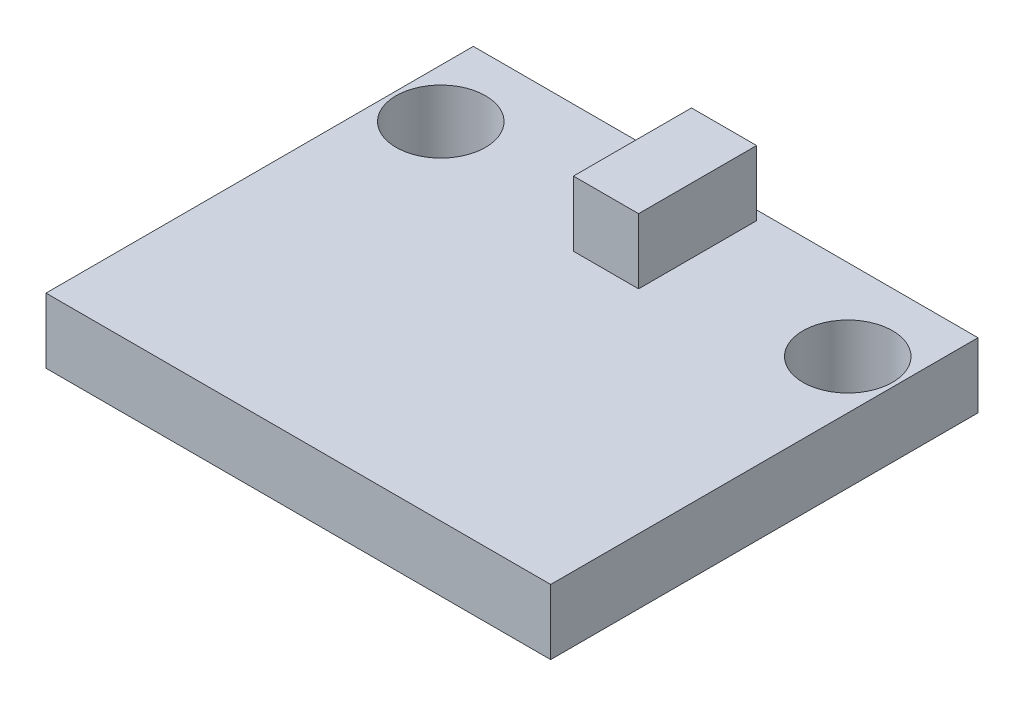
ISO-10303-21;
HEADER;
FILE_DESCRIPTION(('STEP AP214'),'2;1');
FILE_NAME('part.step','',(''),(''),'','','');
FILE_SCHEMA(('AUTOMOTIVE_DESIGN { 1 0 10303 214 1 1 1 1 }'));
ENDSEC;
DATA;
#1=APPLICATION_CONTEXT('core data for automotive mechanical design processes');
#2=APPLICATION_PROTOCOL_DEFINITION('international standard','automotive_design',2000,#1);
#3=PRODUCT_CONTEXT('',#1,'mechanical');
#4=PRODUCT('Part','Part','',(#3));
#5=PRODUCT_RELATED_PRODUCT_CATEGORY('part','',(#4));
#6=PRODUCT_DEFINITION_FORMATION('','',#4);
#7=PRODUCT_DEFINITION_CONTEXT('part definition',#1,'design');
#8=PRODUCT_DEFINITION('design','',#6,#7);
#9=PRODUCT_DEFINITION_SHAPE('','',#8);
#10=(LENGTH_UNIT() NAMED_UNIT(*) SI_UNIT(.MILLI.,.METRE.));
#11=(NAMED_UNIT(*) PLANE_ANGLE_UNIT() SI_UNIT($,.RADIAN.));
#12=(NAMED_UNIT(*) SI_UNIT($,.STERADIAN.) SOLID_ANGLE_UNIT());
#13=UNCERTAINTY_MEASURE_WITH_UNIT(LENGTH_MEASURE(1.E-05),#10,'distance_accuracy_value','');
#14=(GEOMETRIC_REPRESENTATION_CONTEXT(3) GLOBAL_UNCERTAINTY_ASSIGNED_CONTEXT((#13)) GLOBAL_UNIT_ASSIGNED_CONTEXT((#10,
#11,#12)) REPRESENTATION_CONTEXT('',''));
#15=CARTESIAN_POINT('',(0.,0.,0.));
#16=DIRECTION('',(0.,0.,1.));
#17=DIRECTION('',(1.,0.,0.));
#18=AXIS2_PLACEMENT_3D('',#15,#16,#17);
#19=CARTESIAN_POINT('',(0.8,3.2,1.45));
#20=DIRECTION('',(-1.,0.,0.));
#21=DIRECTION('',(0.,0.,1.));
#22=AXIS2_PLACEMENT_3D('',#19,#20,#21);
#23=PLANE('',#22);
#24=DIRECTION('',(0.,0.,-1.));
#25=VECTOR('',#24,1.);
#26=CARTESIAN_POINT('',(0.8,1.6,1.45));
#27=LINE('',#26,#25);
#28=CARTESIAN_POINT('',(0.8,1.6,1.45));
#29=VERTEX_POINT('',#28);
#30=CARTESIAN_POINT('',(0.8,1.6,-1.45));
#31=VERTEX_POINT('',#30);
#32=EDGE_CURVE('E110',#29,#31,#27,.T.);
#33=ORIENTED_EDGE('',*,*,#32,.T.);
#34=DIRECTION('',(0.,-1.,0.));
#35=VECTOR('',#34,1.);
#36=CARTESIAN_POINT('',(0.8,3.2,-1.45));
#37=LINE('',#36,#35);
#38=CARTESIAN_POINT('',(0.8,3.2,-1.45));
#39=VERTEX_POINT('',#38);
#40=EDGE_CURVE('E12',#39,#31,#37,.T.);
#41=ORIENTED_EDGE('',*,*,#40,.F.);
#42=DIRECTION('',(0.,0.,-1.));
#43=VECTOR('',#42,1.);
#44=CARTESIAN_POINT('',(0.8,3.2,1.45));
#45=LINE('',#44,#43);
#46=CARTESIAN_POINT('',(0.8,3.2,1.45));
#47=VERTEX_POINT('',#46);
#48=EDGE_CURVE('E98',#47,#39,#45,.T.);
#49=ORIENTED_EDGE('',*,*,#48,.F.);
#50=DIRECTION('',(0.,-1.,0.));
#51=VECTOR('',#50,1.);
#52=CARTESIAN_POINT('',(0.8,3.2,1.45));
#53=LINE('',#52,#51);
#54=EDGE_CURVE('E106',#47,#29,#53,.T.);
#55=ORIENTED_EDGE('',*,*,#54,.T.);
#56=EDGE_LOOP('',(#33,#41,#49,#55));
#57=FACE_BOUND('',#56,.T.);
#58=ADVANCED_FACE('F47',(#57),#23,.F.);
#59=CARTESIAN_POINT('',(-0.8,3.2,-1.45));
#60=DIRECTION('',(0.,0.,1.));
#61=DIRECTION('',(1.,0.,0.));
#62=AXIS2_PLACEMENT_3D('',#59,#60,#61);
#63=PLANE('',#62);
#64=DIRECTION('',(-1.,0.,0.));
#65=VECTOR('',#64,1.);
#66=CARTESIAN_POINT('',(-0.8,1.6,-1.45));
#67=LINE('',#66,#65);
#68=CARTESIAN_POINT('',(-0.8,1.6,-1.45));
#69=VERTEX_POINT('',#68);
#70=EDGE_CURVE('E102',#31,#69,#67,.T.);
#71=ORIENTED_EDGE('',*,*,#70,.T.);
#72=DIRECTION('',(0.,-1.,0.));
#73=VECTOR('',#72,1.);
#74=CARTESIAN_POINT('',(-0.8,3.2,-1.45));
#75=LINE('',#74,#73);
#76=CARTESIAN_POINT('',(-0.8,3.2,-1.45));
#77=VERTEX_POINT('',#76);
#78=EDGE_CURVE('E55',#77,#69,#75,.T.);
#79=ORIENTED_EDGE('',*,*,#78,.F.);
#80=DIRECTION('',(-1.,0.,0.));
#81=VECTOR('',#80,1.);
#82=CARTESIAN_POINT('',(-0.8,3.2,-1.45));
#83=LINE('',#82,#81);
#84=EDGE_CURVE('E93',#39,#77,#83,.T.);
#85=ORIENTED_EDGE('',*,*,#84,.F.);
#86=ORIENTED_EDGE('',*,*,#40,.T.);
#87=EDGE_LOOP('',(#71,#79,#85,#86));
#88=FACE_BOUND('',#87,.T.);
#89=ADVANCED_FACE('F101',(#88),#63,.F.);
#90=CARTESIAN_POINT('',(-0.8,3.2,1.45));
#91=DIRECTION('',(1.,0.,0.));
#92=DIRECTION('',(0.,0.,-1.));
#93=AXIS2_PLACEMENT_3D('',#90,#91,#92);
#94=PLANE('',#93);
#95=DIRECTION('',(0.,0.,1.));
#96=VECTOR('',#95,1.);
#97=CARTESIAN_POINT('',(-0.8,1.6,1.45));
#98=LINE('',#97,#96);
#99=CARTESIAN_POINT('',(-0.8,1.6,1.45));
#100=VERTEX_POINT('',#99);
#101=EDGE_CURVE('E80',#69,#100,#98,.T.);
#102=ORIENTED_EDGE('',*,*,#101,.T.);
#103=DIRECTION('',(0.,-1.,0.));
#104=VECTOR('',#103,1.);
#105=CARTESIAN_POINT('',(-0.8,3.2,1.45));
#106=LINE('',#105,#104);
#107=CARTESIAN_POINT('',(-0.8,3.2,1.45));
#108=VERTEX_POINT('',#107);
#109=EDGE_CURVE('E103',#108,#100,#106,.T.);
#110=ORIENTED_EDGE('',*,*,#109,.F.);
#111=DIRECTION('',(0.,0.,1.));
#112=VECTOR('',#111,1.);
#113=CARTESIAN_POINT('',(-0.8,3.2,1.45));
#114=LINE('',#113,#112);
#115=EDGE_CURVE('E96',#77,#108,#114,.T.);
#116=ORIENTED_EDGE('',*,*,#115,.F.);
#117=ORIENTED_EDGE('',*,*,#78,.T.);
#118=EDGE_LOOP('',(#102,#110,#116,#117));
#119=FACE_BOUND('',#118,.T.);
#120=ADVANCED_FACE('F104',(#119),#94,.F.);
#121=CARTESIAN_POINT('',(-0.8,3.2,1.45));
#122=DIRECTION('',(0.,0.,-1.));
#123=DIRECTION('',(-1.,0.,0.));
#124=AXIS2_PLACEMENT_3D('',#121,#122,#123);
#125=PLANE('',#124);
#126=DIRECTION('',(1.,0.,0.));
#127=VECTOR('',#126,1.);
#128=CARTESIAN_POINT('',(-0.8,1.6,1.45));
#129=LINE('',#128,#127);
#130=EDGE_CURVE('E86',#100,#29,#129,.T.);
#131=ORIENTED_EDGE('',*,*,#130,.T.);
#132=ORIENTED_EDGE('',*,*,#54,.F.);
#133=DIRECTION('',(1.,0.,0.));
#134=VECTOR('',#133,1.);
#135=CARTESIAN_POINT('',(-0.8,3.2,1.45));
#136=LINE('',#135,#134);
#137=EDGE_CURVE('E63',#108,#47,#136,.T.);
#138=ORIENTED_EDGE('',*,*,#137,.F.);
#139=ORIENTED_EDGE('',*,*,#109,.T.);
#140=EDGE_LOOP('',(#131,#132,#138,#139));
#141=FACE_BOUND('',#140,.T.);
#142=ADVANCED_FACE('F117',(#141),#125,.F.);
#143=CARTESIAN_POINT('',(0.,3.2,0.));
#144=DIRECTION('',(0.,-1.,0.));
#145=DIRECTION('',(0.,0.,-1.));
#146=AXIS2_PLACEMENT_3D('',#143,#144,#145);
#147=PLANE('',#146);
#148=ORIENTED_EDGE('',*,*,#48,.T.);
#149=ORIENTED_EDGE('',*,*,#84,.T.);
#150=ORIENTED_EDGE('',*,*,#115,.T.);
#151=ORIENTED_EDGE('',*,*,#137,.T.);
#152=EDGE_LOOP('',(#148,#149,#150,#151));
#153=FACE_BOUND('',#152,.T.);
#154=ADVANCED_FACE('F94',(#153),#147,.F.);
#155=CARTESIAN_POINT('',(0.,1.6,0.));
#156=DIRECTION('',(0.,-1.,0.));
#157=DIRECTION('',(0.,0.,-1.));
#158=AXIS2_PLACEMENT_3D('',#155,#156,#157);
#159=PLANE('',#158);
#160=ORIENTED_EDGE('',*,*,#32,.F.);
#161=ORIENTED_EDGE('',*,*,#130,.F.);
#162=ORIENTED_EDGE('',*,*,#101,.F.);
#163=ORIENTED_EDGE('',*,*,#70,.F.);
#164=EDGE_LOOP('',(#160,#161,#162,#163));
#165=FACE_BOUND('',#164,.T.);
#166=ADVANCED_FACE('F120',(#165),#159,.T.);
#167=CLOSED_SHELL('',(#58,#89,#120,#142,#154,#166));
#168=MANIFOLD_SOLID_BREP('B2',#167);
#169=CARTESIAN_POINT('',(-6.39,1.6,-1.68));
#170=DIRECTION('',(1.,0.,0.));
#171=DIRECTION('',(0.,0.,-1.));
#172=AXIS2_PLACEMENT_3D('',#169,#170,#171);
#173=PLANE('',#172);
#174=DIRECTION('',(0.,0.,1.));
#175=VECTOR('',#174,1.);
#176=CARTESIAN_POINT('',(-6.39,0.,-1.68));
#177=LINE('',#176,#175);
#178=CARTESIAN_POINT('',(-6.39,0.,-1.68));
#179=VERTEX_POINT('',#178);
#180=CARTESIAN_POINT('',(-6.39,0.,8.82));
#181=VERTEX_POINT('',#180);
#182=EDGE_CURVE('E234',#179,#181,#177,.T.);
#183=ORIENTED_EDGE('',*,*,#182,.T.);
#184=DIRECTION('',(0.,-1.,0.));
#185=VECTOR('',#184,1.);
#186=CARTESIAN_POINT('',(-6.39,1.6,8.82));
#187=LINE('',#186,#185);
#188=CARTESIAN_POINT('',(-6.39,1.6,8.82));
#189=VERTEX_POINT('',#188);
#190=EDGE_CURVE('E45',#189,#181,#187,.T.);
#191=ORIENTED_EDGE('',*,*,#190,.F.);
#192=DIRECTION('',(0.,0.,1.));
#193=VECTOR('',#192,1.);
#194=CARTESIAN_POINT('',(-6.39,1.6,-1.68));
#195=LINE('',#194,#193);
#196=CARTESIAN_POINT('',(-6.39,1.6,-1.68));
#197=VERTEX_POINT('',#196);
#198=EDGE_CURVE('E222',#197,#189,#195,.T.);
#199=ORIENTED_EDGE('',*,*,#198,.F.);
#200=DIRECTION('',(0.,-1.,0.));
#201=VECTOR('',#200,1.);
#202=CARTESIAN_POINT('',(-6.39,1.6,-1.68));
#203=LINE('',#202,#201);
#204=EDGE_CURVE('E230',#197,#179,#203,.T.);
#205=ORIENTED_EDGE('',*,*,#204,.T.);
#206=EDGE_LOOP('',(#183,#191,#199,#205));
#207=FACE_BOUND('',#206,.T.);
#208=ADVANCED_FACE('F171',(#207),#173,.F.);
#209=CARTESIAN_POINT('',(-6.39,1.6,8.82));
#210=DIRECTION('',(0.,0.,-1.));
#211=DIRECTION('',(-1.,0.,0.));
#212=AXIS2_PLACEMENT_3D('',#209,#210,#211);
#213=PLANE('',#212);
#214=DIRECTION('',(1.,0.,0.));
#215=VECTOR('',#214,1.);
#216=CARTESIAN_POINT('',(-6.39,0.,8.82));
#217=LINE('',#216,#215);
#218=CARTESIAN_POINT('',(6.01,0.,8.82));
#219=VERTEX_POINT('',#218);
#220=EDGE_CURVE('E226',#181,#219,#217,.T.);
#221=ORIENTED_EDGE('',*,*,#220,.T.);
#222=DIRECTION('',(0.,-1.,0.));
#223=VECTOR('',#222,1.);
#224=CARTESIAN_POINT('',(6.01,1.6,8.82));
#225=LINE('',#224,#223);
#226=CARTESIAN_POINT('',(6.01,1.6,8.82));
#227=VERTEX_POINT('',#226);
#228=EDGE_CURVE('E179',#227,#219,#225,.T.);
#229=ORIENTED_EDGE('',*,*,#228,.F.);
#230=DIRECTION('',(1.,0.,0.));
#231=VECTOR('',#230,1.);
#232=CARTESIAN_POINT('',(-6.39,1.6,8.82));
#233=LINE('',#232,#231);
#234=EDGE_CURVE('E217',#189,#227,#233,.T.);
#235=ORIENTED_EDGE('',*,*,#234,.F.);
#236=ORIENTED_EDGE('',*,*,#190,.T.);
#237=EDGE_LOOP('',(#221,#229,#235,#236));
#238=FACE_BOUND('',#237,.T.);
#239=ADVANCED_FACE('F225',(#238),#213,.F.);
#240=CARTESIAN_POINT('',(6.01,1.6,-1.68));
#241=DIRECTION('',(-1.,0.,0.));
#242=DIRECTION('',(0.,0.,1.));
#243=AXIS2_PLACEMENT_3D('',#240,#241,#242);
#244=PLANE('',#243);
#245=DIRECTION('',(0.,0.,-1.));
#246=VECTOR('',#245,1.);
#247=CARTESIAN_POINT('',(6.01,0.,-1.68));
#248=LINE('',#247,#246);
#249=CARTESIAN_POINT('',(6.01,0.,-1.68));
#250=VERTEX_POINT('',#249);
#251=EDGE_CURVE('E204',#219,#250,#248,.T.);
#252=ORIENTED_EDGE('',*,*,#251,.T.);
#253=DIRECTION('',(0.,-1.,0.));
#254=VECTOR('',#253,1.);
#255=CARTESIAN_POINT('',(6.01,1.6,-1.68));
#256=LINE('',#255,#254);
#257=CARTESIAN_POINT('',(6.01,1.6,-1.68));
#258=VERTEX_POINT('',#257);
#259=EDGE_CURVE('E227',#258,#250,#256,.T.);
#260=ORIENTED_EDGE('',*,*,#259,.F.);
#261=DIRECTION('',(0.,0.,-1.));
#262=VECTOR('',#261,1.);
#263=CARTESIAN_POINT('',(6.01,1.6,-1.68));
#264=LINE('',#263,#262);
#265=EDGE_CURVE('E220',#227,#258,#264,.T.);
#266=ORIENTED_EDGE('',*,*,#265,.F.);
#267=ORIENTED_EDGE('',*,*,#228,.T.);
#268=EDGE_LOOP('',(#252,#260,#266,#267));
#269=FACE_BOUND('',#268,.T.);
#270=ADVANCED_FACE('F228',(#269),#244,.F.);
#271=CARTESIAN_POINT('',(-6.39,1.6,-1.68));
#272=DIRECTION('',(0.,0.,1.));
#273=DIRECTION('',(1.,0.,0.));
#274=AXIS2_PLACEMENT_3D('',#271,#272,#273);
#275=PLANE('',#274);
#276=DIRECTION('',(-1.,0.,0.));
#277=VECTOR('',#276,1.);
#278=CARTESIAN_POINT('',(-6.39,0.,-1.68));
#279=LINE('',#278,#277);
#280=EDGE_CURVE('E210',#250,#179,#279,.T.);
#281=ORIENTED_EDGE('',*,*,#280,.T.);
#282=ORIENTED_EDGE('',*,*,#204,.F.);
#283=DIRECTION('',(-1.,0.,0.));
#284=VECTOR('',#283,1.);
#285=CARTESIAN_POINT('',(-6.39,1.6,-1.68));
#286=LINE('',#285,#284);
#287=EDGE_CURVE('E187',#258,#197,#286,.T.);
#288=ORIENTED_EDGE('',*,*,#287,.F.);
#289=ORIENTED_EDGE('',*,*,#259,.T.);
#290=EDGE_LOOP('',(#281,#282,#288,#289));
#291=FACE_BOUND('',#290,.T.);
#292=ADVANCED_FACE('F242',(#291),#275,.F.);
#293=CARTESIAN_POINT('',(0.,1.6,0.));
#294=DIRECTION('',(0.,1.,0.));
#295=DIRECTION('',(0.,0.,1.));
#296=AXIS2_PLACEMENT_3D('',#293,#294,#295);
#297=PLANE('',#296);
#298=CARTESIAN_POINT('',(4.81,1.6,0.319999999999997));
#299=DIRECTION('',(0.,1.,0.));
#300=DIRECTION('',(0.,0.,1.));
#301=AXIS2_PLACEMENT_3D('',#298,#299,#300);
#302=CIRCLE('',#301,1.1);
#303=CARTESIAN_POINT('',(4.81,1.6,1.42));
#304=VERTEX_POINT('',#303);
#305=EDGE_CURVE('E237',#304,#304,#302,.T.);
#306=ORIENTED_EDGE('',*,*,#305,.F.);
#307=EDGE_LOOP('',(#306));
#308=FACE_BOUND('',#307,.T.);
#309=CARTESIAN_POINT('',(-5.19,1.6,0.319999999999994));
#310=DIRECTION('',(0.,1.,0.));
#311=DIRECTION('',(0.,0.,-1.));
#312=AXIS2_PLACEMENT_3D('',#309,#310,#311);
#313=CIRCLE('',#312,1.1);
#314=CARTESIAN_POINT('',(-5.19,1.6,-0.780000000000006));
#315=VERTEX_POINT('',#314);
#316=EDGE_CURVE('E251',#315,#315,#313,.T.);
#317=ORIENTED_EDGE('',*,*,#316,.F.);
#318=EDGE_LOOP('',(#317));
#319=FACE_BOUND('',#318,.T.);
#320=ORIENTED_EDGE('',*,*,#198,.T.);
#321=ORIENTED_EDGE('',*,*,#234,.T.);
#322=ORIENTED_EDGE('',*,*,#265,.T.);
#323=ORIENTED_EDGE('',*,*,#287,.T.);
#324=EDGE_LOOP('',(#320,#321,#322,#323));
#325=FACE_BOUND('',#324,.T.);
#326=ADVANCED_FACE('F218',(#308,#319,#325),#297,.T.);
#327=CARTESIAN_POINT('',(0.,0.,0.));
#328=DIRECTION('',(0.,1.,0.));
#329=DIRECTION('',(0.,0.,1.));
#330=AXIS2_PLACEMENT_3D('',#327,#328,#329);
#331=PLANE('',#330);
#332=CARTESIAN_POINT('',(4.81,0.,0.319999999999997));
#333=DIRECTION('',(0.,1.,0.));
#334=DIRECTION('',(0.,0.,1.));
#335=AXIS2_PLACEMENT_3D('',#332,#333,#334);
#336=CIRCLE('',#335,1.1);
#337=CARTESIAN_POINT('',(4.81,0.,1.42));
#338=VERTEX_POINT('',#337);
#339=EDGE_CURVE('E254',#338,#338,#336,.T.);
#340=ORIENTED_EDGE('',*,*,#339,.T.);
#341=EDGE_LOOP('',(#340));
#342=FACE_BOUND('',#341,.T.);
#343=CARTESIAN_POINT('',(-5.19,0.,0.319999999999994));
#344=DIRECTION('',(0.,1.,0.));
#345=DIRECTION('',(0.,0.,-1.));
#346=AXIS2_PLACEMENT_3D('',#343,#344,#345);
#347=CIRCLE('',#346,1.1);
#348=CARTESIAN_POINT('',(-5.19,0.,-0.780000000000006));
#349=VERTEX_POINT('',#348);
#350=EDGE_CURVE('E248',#349,#349,#347,.T.);
#351=ORIENTED_EDGE('',*,*,#350,.T.);
#352=EDGE_LOOP('',(#351));
#353=FACE_BOUND('',#352,.T.);
#354=ORIENTED_EDGE('',*,*,#182,.F.);
#355=ORIENTED_EDGE('',*,*,#280,.F.);
#356=ORIENTED_EDGE('',*,*,#251,.F.);
#357=ORIENTED_EDGE('',*,*,#220,.F.);
#358=EDGE_LOOP('',(#354,#355,#356,#357));
#359=FACE_BOUND('',#358,.T.);
#360=ADVANCED_FACE('F245',(#342,#353,#359),#331,.F.);
#361=CARTESIAN_POINT('',(-5.19,1.6,0.319999999999994));
#362=DIRECTION('',(0.,-1.,0.));
#363=DIRECTION('',(0.,0.,-1.));
#364=AXIS2_PLACEMENT_3D('',#361,#362,#363);
#365=CYLINDRICAL_SURFACE('',#364,1.1);
#366=ORIENTED_EDGE('',*,*,#316,.T.);
#367=EDGE_LOOP('',(#366));
#368=FACE_BOUND('',#367,.T.);
#369=ORIENTED_EDGE('',*,*,#350,.F.);
#370=EDGE_LOOP('',(#369));
#371=FACE_BOUND('',#370,.T.);
#372=ADVANCED_FACE('F268',(#368,#371),#365,.F.);
#373=CARTESIAN_POINT('',(4.81,1.6,0.319999999999997));
#374=DIRECTION('',(0.,-1.,0.));
#375=DIRECTION('',(0.,0.,-1.));
#376=AXIS2_PLACEMENT_3D('',#373,#374,#375);
#377=CYLINDRICAL_SURFACE('',#376,1.1);
#378=ORIENTED_EDGE('',*,*,#305,.T.);
#379=EDGE_LOOP('',(#378));
#380=FACE_BOUND('',#379,.T.);
#381=ORIENTED_EDGE('',*,*,#339,.F.);
#382=EDGE_LOOP('',(#381));
#383=FACE_BOUND('',#382,.T.);
#384=ADVANCED_FACE('F260',(#380,#383),#377,.F.);
#385=CLOSED_SHELL('',(#208,#239,#270,#292,#326,#360,#372,#384));
#386=MANIFOLD_SOLID_BREP('B6',#385);
#387=ADVANCED_BREP_SHAPE_REPRESENTATION('',(#18,#168,#386),#14);
#388=SHAPE_DEFINITION_REPRESENTATION(#9,#387);
ENDSEC;
END-ISO-10303-21;
